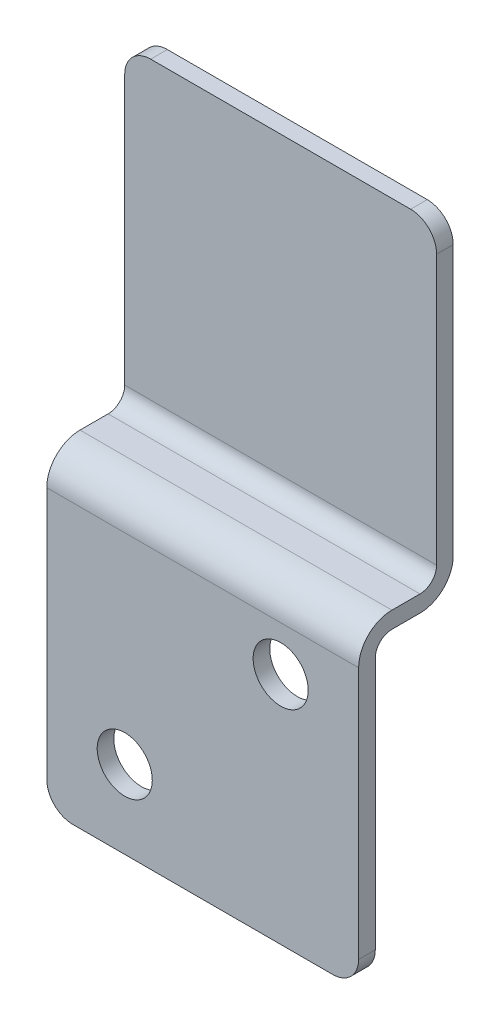
ISO-10303-21;
HEADER;
FILE_DESCRIPTION(('STEP AP214'),'2;1');
FILE_NAME('part.step','',(''),(''),'','','');
FILE_SCHEMA(('AUTOMOTIVE_DESIGN { 1 0 10303 214 1 1 1 1 }'));
ENDSEC;
DATA;
#1=APPLICATION_CONTEXT('core data for automotive mechanical design processes');
#2=APPLICATION_PROTOCOL_DEFINITION('international standard','automotive_design',2000,#1);
#3=PRODUCT_CONTEXT('',#1,'mechanical');
#4=PRODUCT('Part','Part','',(#3));
#5=PRODUCT_RELATED_PRODUCT_CATEGORY('part','',(#4));
#6=PRODUCT_DEFINITION_FORMATION('','',#4);
#7=PRODUCT_DEFINITION_CONTEXT('part definition',#1,'design');
#8=PRODUCT_DEFINITION('design','',#6,#7);
#9=PRODUCT_DEFINITION_SHAPE('','',#8);
#10=(LENGTH_UNIT() NAMED_UNIT(*) SI_UNIT(.MILLI.,.METRE.));
#11=(NAMED_UNIT(*) PLANE_ANGLE_UNIT() SI_UNIT($,.RADIAN.));
#12=(NAMED_UNIT(*) SI_UNIT($,.STERADIAN.) SOLID_ANGLE_UNIT());
#13=UNCERTAINTY_MEASURE_WITH_UNIT(LENGTH_MEASURE(1.E-05),#10,'distance_accuracy_value','');
#14=(GEOMETRIC_REPRESENTATION_CONTEXT(3) GLOBAL_UNCERTAINTY_ASSIGNED_CONTEXT((#13)) GLOBAL_UNIT_ASSIGNED_CONTEXT((#10,
#11,#12)) REPRESENTATION_CONTEXT('',''));
#15=CARTESIAN_POINT('',(0.,0.,0.));
#16=DIRECTION('',(0.,0.,1.));
#17=DIRECTION('',(1.,0.,0.));
#18=AXIS2_PLACEMENT_3D('',#15,#16,#17);
#19=CARTESIAN_POINT('',(38.1,0.,0.));
#20=DIRECTION('',(0.,-1.,0.));
#21=DIRECTION('',(0.,0.,-1.));
#22=AXIS2_PLACEMENT_3D('',#19,#20,#21);
#23=PLANE('',#22);
#24=DIRECTION('',(-1.,0.,0.));
#25=VECTOR('',#24,1.);
#26=CARTESIAN_POINT('',(38.1,0.,-2.032));
#27=LINE('',#26,#25);
#28=CARTESIAN_POINT('',(34.925,0.,-2.032));
#29=VERTEX_POINT('',#28);
#30=CARTESIAN_POINT('',(3.17500000000001,0.,-2.032));
#31=VERTEX_POINT('',#30);
#32=EDGE_CURVE('E187',#29,#31,#27,.T.);
#33=ORIENTED_EDGE('',*,*,#32,.T.);
#34=DIRECTION('',(0.,0.,1.));
#35=VECTOR('',#34,1.);
#36=CARTESIAN_POINT('',(3.175,0.,0.));
#37=LINE('',#36,#35);
#38=CARTESIAN_POINT('',(3.17500000000001,0.,0.));
#39=VERTEX_POINT('',#38);
#40=EDGE_CURVE('E247',#31,#39,#37,.T.);
#41=ORIENTED_EDGE('',*,*,#40,.T.);
#42=DIRECTION('',(-1.,0.,0.));
#43=VECTOR('',#42,1.);
#44=CARTESIAN_POINT('',(38.1,0.,0.));
#45=LINE('',#44,#43);
#46=CARTESIAN_POINT('',(34.925,0.,0.));
#47=VERTEX_POINT('',#46);
#48=EDGE_CURVE('E172',#47,#39,#45,.T.);
#49=ORIENTED_EDGE('',*,*,#48,.F.);
#50=DIRECTION('',(0.,0.,1.));
#51=VECTOR('',#50,1.);
#52=CARTESIAN_POINT('',(34.925,0.,0.));
#53=LINE('',#52,#51);
#54=EDGE_CURVE('E245',#47,#29,#53,.F.);
#55=ORIENTED_EDGE('',*,*,#54,.T.);
#56=EDGE_LOOP('',(#33,#41,#49,#55));
#57=FACE_BOUND('',#56,.T.);
#58=ADVANCED_FACE('F32',(#57),#23,.F.);
#59=CARTESIAN_POINT('',(38.1,0.,0.));
#60=DIRECTION('',(0.,0.,-1.));
#61=DIRECTION('',(0.,1.,0.));
#62=AXIS2_PLACEMENT_3D('',#59,#60,#61);
#63=PLANE('',#62);
#64=ORIENTED_EDGE('',*,*,#48,.T.);
#65=CARTESIAN_POINT('',(3.175,-3.175,0.));
#66=DIRECTION('',(0.,0.,-1.));
#67=DIRECTION('',(0.,1.,0.));
#68=AXIS2_PLACEMENT_3D('',#65,#66,#67);
#69=CIRCLE('',#68,3.175);
#70=CARTESIAN_POINT('',(0.,-3.175,0.));
#71=VERTEX_POINT('',#70);
#72=EDGE_CURVE('E251',#39,#71,#69,.F.);
#73=ORIENTED_EDGE('',*,*,#72,.T.);
#74=DIRECTION('',(0.,-1.,0.));
#75=VECTOR('',#74,1.);
#76=CARTESIAN_POINT('',(0.,0.,0.));
#77=LINE('',#76,#75);
#78=CARTESIAN_POINT('',(0.,-36.068,0.));
#79=VERTEX_POINT('',#78);
#80=EDGE_CURVE('E262',#71,#79,#77,.T.);
#81=ORIENTED_EDGE('',*,*,#80,.T.);
#82=DIRECTION('',(-1.,0.,0.));
#83=VECTOR('',#82,1.);
#84=CARTESIAN_POINT('',(38.1,-36.068,0.));
#85=LINE('',#84,#83);
#86=CARTESIAN_POINT('',(38.1,-36.068,0.));
#87=VERTEX_POINT('',#86);
#88=EDGE_CURVE('E162',#79,#87,#85,.F.);
#89=ORIENTED_EDGE('',*,*,#88,.T.);
#90=DIRECTION('',(0.,-1.,0.));
#91=VECTOR('',#90,1.);
#92=CARTESIAN_POINT('',(38.1,0.,0.));
#93=LINE('',#92,#91);
#94=CARTESIAN_POINT('',(38.1,-3.175,0.));
#95=VERTEX_POINT('',#94);
#96=EDGE_CURVE('E181',#95,#87,#93,.T.);
#97=ORIENTED_EDGE('',*,*,#96,.F.);
#98=CARTESIAN_POINT('',(34.925,-3.175,0.));
#99=DIRECTION('',(0.,0.,-1.));
#100=DIRECTION('',(0.,1.,0.));
#101=AXIS2_PLACEMENT_3D('',#98,#99,#100);
#102=CIRCLE('',#101,3.175);
#103=EDGE_CURVE('E57',#95,#47,#102,.F.);
#104=ORIENTED_EDGE('',*,*,#103,.T.);
#105=EDGE_LOOP('',(#64,#73,#81,#89,#97,#104));
#106=FACE_BOUND('',#105,.T.);
#107=ADVANCED_FACE('F334',(#106),#63,.F.);
#108=CARTESIAN_POINT('',(38.1,-38.1,0.));
#109=DIRECTION('',(0.,-1.,0.));
#110=DIRECTION('',(0.,0.,-1.));
#111=AXIS2_PLACEMENT_3D('',#108,#109,#110);
#112=PLANE('',#111);
#113=DIRECTION('',(0.,0.,1.));
#114=VECTOR('',#113,1.);
#115=CARTESIAN_POINT('',(0.,-38.1,0.));
#116=LINE('',#115,#114);
#117=CARTESIAN_POINT('',(0.,-38.1,2.032));
#118=VERTEX_POINT('',#117);
#119=CARTESIAN_POINT('',(0.,-38.1,5.461));
#120=VERTEX_POINT('',#119);
#121=EDGE_CURVE('E283',#118,#120,#116,.T.);
#122=ORIENTED_EDGE('',*,*,#121,.T.);
#123=DIRECTION('',(-1.,0.,0.));
#124=VECTOR('',#123,1.);
#125=CARTESIAN_POINT('',(38.1,-38.1,5.461));
#126=LINE('',#125,#124);
#127=CARTESIAN_POINT('',(38.1,-38.1,5.461));
#128=VERTEX_POINT('',#127);
#129=EDGE_CURVE('E217',#120,#128,#126,.F.);
#130=ORIENTED_EDGE('',*,*,#129,.T.);
#131=DIRECTION('',(0.,0.,1.));
#132=VECTOR('',#131,1.);
#133=CARTESIAN_POINT('',(38.1,-38.1,0.));
#134=LINE('',#133,#132);
#135=CARTESIAN_POINT('',(38.1,-38.1,2.032));
#136=VERTEX_POINT('',#135);
#137=EDGE_CURVE('E272',#136,#128,#134,.T.);
#138=ORIENTED_EDGE('',*,*,#137,.F.);
#139=DIRECTION('',(-1.,0.,0.));
#140=VECTOR('',#139,1.);
#141=CARTESIAN_POINT('',(0.,-38.1,2.032));
#142=LINE('',#141,#140);
#143=EDGE_CURVE('E200',#136,#118,#142,.T.);
#144=ORIENTED_EDGE('',*,*,#143,.T.);
#145=EDGE_LOOP('',(#122,#130,#138,#144));
#146=FACE_BOUND('',#145,.T.);
#147=ADVANCED_FACE('F316',(#146),#112,.F.);
#148=CARTESIAN_POINT('',(38.1,-38.1,9.525));
#149=DIRECTION('',(0.,0.,-1.));
#150=DIRECTION('',(0.,1.,0.));
#151=AXIS2_PLACEMENT_3D('',#148,#149,#150);
#152=PLANE('',#151);
#153=CARTESIAN_POINT('',(9.525,-66.675,9.52500000000001));
#154=DIRECTION('',(0.,0.,1.));
#155=DIRECTION('',(1.,0.,0.));
#156=AXIS2_PLACEMENT_3D('',#153,#154,#155);
#157=CIRCLE('',#156,3.3655);
#158=CARTESIAN_POINT('',(12.8905,-66.675,9.52500000000001));
#159=VERTEX_POINT('',#158);
#160=EDGE_CURVE('E258',#159,#159,#157,.T.);
#161=ORIENTED_EDGE('',*,*,#160,.F.);
#162=EDGE_LOOP('',(#161));
#163=FACE_BOUND('',#162,.T.);
#164=CARTESIAN_POINT('',(28.575,-47.625,9.52500000000001));
#165=DIRECTION('',(0.,0.,1.));
#166=DIRECTION('',(1.,0.,0.));
#167=AXIS2_PLACEMENT_3D('',#164,#165,#166);
#168=CIRCLE('',#167,3.36549999999999);
#169=CARTESIAN_POINT('',(31.9405,-47.625,9.52500000000001));
#170=VERTEX_POINT('',#169);
#171=EDGE_CURVE('E264',#170,#170,#168,.T.);
#172=ORIENTED_EDGE('',*,*,#171,.F.);
#173=EDGE_LOOP('',(#172));
#174=FACE_BOUND('',#173,.T.);
#175=DIRECTION('',(0.,-1.,0.));
#176=VECTOR('',#175,1.);
#177=CARTESIAN_POINT('',(0.,-38.1,9.525));
#178=LINE('',#177,#176);
#179=CARTESIAN_POINT('',(0.,-42.164,9.525));
#180=VERTEX_POINT('',#179);
#181=CARTESIAN_POINT('',(0.,-73.025,9.52499999999999));
#182=VERTEX_POINT('',#181);
#183=EDGE_CURVE('E183',#180,#182,#178,.T.);
#184=ORIENTED_EDGE('',*,*,#183,.T.);
#185=CARTESIAN_POINT('',(3.175,-73.025,9.52499999999999));
#186=DIRECTION('',(0.,0.,-1.));
#187=DIRECTION('',(0.,1.,0.));
#188=AXIS2_PLACEMENT_3D('',#185,#186,#187);
#189=CIRCLE('',#188,3.175);
#190=CARTESIAN_POINT('',(3.17500000000001,-76.2,9.52499999999999));
#191=VERTEX_POINT('',#190);
#192=EDGE_CURVE('E243',#182,#191,#189,.F.);
#193=ORIENTED_EDGE('',*,*,#192,.T.);
#194=DIRECTION('',(-1.,0.,0.));
#195=VECTOR('',#194,1.);
#196=CARTESIAN_POINT('',(38.1,-76.2,9.52499999999999));
#197=LINE('',#196,#195);
#198=CARTESIAN_POINT('',(34.925,-76.2,9.52499999999999));
#199=VERTEX_POINT('',#198);
#200=EDGE_CURVE('E194',#199,#191,#197,.T.);
#201=ORIENTED_EDGE('',*,*,#200,.F.);
#202=CARTESIAN_POINT('',(34.925,-73.025,9.52499999999999));
#203=DIRECTION('',(0.,0.,-1.));
#204=DIRECTION('',(0.,1.,0.));
#205=AXIS2_PLACEMENT_3D('',#202,#203,#204);
#206=CIRCLE('',#205,3.175);
#207=CARTESIAN_POINT('',(38.1,-73.025,9.52499999999999));
#208=VERTEX_POINT('',#207);
#209=EDGE_CURVE('E241',#199,#208,#206,.F.);
#210=ORIENTED_EDGE('',*,*,#209,.T.);
#211=DIRECTION('',(0.,-1.,0.));
#212=VECTOR('',#211,1.);
#213=CARTESIAN_POINT('',(38.1,-38.1,9.525));
#214=LINE('',#213,#212);
#215=CARTESIAN_POINT('',(38.1,-42.164,9.525));
#216=VERTEX_POINT('',#215);
#217=EDGE_CURVE('E275',#216,#208,#214,.T.);
#218=ORIENTED_EDGE('',*,*,#217,.F.);
#219=DIRECTION('',(-1.,0.,0.));
#220=VECTOR('',#219,1.);
#221=CARTESIAN_POINT('',(38.1,-42.164,9.525));
#222=LINE('',#221,#220);
#223=EDGE_CURVE('E211',#216,#180,#222,.T.);
#224=ORIENTED_EDGE('',*,*,#223,.T.);
#225=EDGE_LOOP('',(#184,#193,#201,#210,#218,#224));
#226=FACE_BOUND('',#225,.T.);
#227=ADVANCED_FACE('F289',(#163,#174,#226),#152,.F.);
#228=CARTESIAN_POINT('',(38.1,-76.2,9.52499999999999));
#229=DIRECTION('',(0.,1.,0.));
#230=DIRECTION('',(0.,0.,1.));
#231=AXIS2_PLACEMENT_3D('',#228,#229,#230);
#232=PLANE('',#231);
#233=ORIENTED_EDGE('',*,*,#200,.T.);
#234=DIRECTION('',(0.,0.,-1.));
#235=VECTOR('',#234,1.);
#236=CARTESIAN_POINT('',(3.175,-76.2,7.49299999999999));
#237=LINE('',#236,#235);
#238=CARTESIAN_POINT('',(3.17500000000001,-76.2,7.49299999999999));
#239=VERTEX_POINT('',#238);
#240=EDGE_CURVE('E230',#191,#239,#237,.T.);
#241=ORIENTED_EDGE('',*,*,#240,.T.);
#242=DIRECTION('',(-1.,0.,0.));
#243=VECTOR('',#242,1.);
#244=CARTESIAN_POINT('',(38.1,-76.2,7.49299999999999));
#245=LINE('',#244,#243);
#246=CARTESIAN_POINT('',(34.925,-76.2,7.49299999999999));
#247=VERTEX_POINT('',#246);
#248=EDGE_CURVE('E190',#247,#239,#245,.T.);
#249=ORIENTED_EDGE('',*,*,#248,.F.);
#250=DIRECTION('',(0.,0.,-1.));
#251=VECTOR('',#250,1.);
#252=CARTESIAN_POINT('',(34.925,-76.2,9.52499999999999));
#253=LINE('',#252,#251);
#254=EDGE_CURVE('E228',#247,#199,#253,.F.);
#255=ORIENTED_EDGE('',*,*,#254,.T.);
#256=EDGE_LOOP('',(#233,#241,#249,#255));
#257=FACE_BOUND('',#256,.T.);
#258=ADVANCED_FACE('F299',(#257),#232,.F.);
#259=CARTESIAN_POINT('',(38.1,-40.132,7.493));
#260=DIRECTION('',(0.,0.,1.));
#261=DIRECTION('',(0.,-1.,0.));
#262=AXIS2_PLACEMENT_3D('',#259,#260,#261);
#263=PLANE('',#262);
#264=CARTESIAN_POINT('',(9.525,-66.675,7.49299999999999));
#265=DIRECTION('',(0.,0.,1.));
#266=DIRECTION('',(0.,-1.,0.));
#267=AXIS2_PLACEMENT_3D('',#264,#265,#266);
#268=CIRCLE('',#267,3.3655);
#269=CARTESIAN_POINT('',(9.525,-70.0405,7.49299999999999));
#270=VERTEX_POINT('',#269);
#271=EDGE_CURVE('E36',#270,#270,#268,.T.);
#272=ORIENTED_EDGE('',*,*,#271,.T.);
#273=EDGE_LOOP('',(#272));
#274=FACE_BOUND('',#273,.T.);
#275=CARTESIAN_POINT('',(28.575,-47.625,7.493));
#276=DIRECTION('',(0.,0.,1.));
#277=DIRECTION('',(0.,-1.,0.));
#278=AXIS2_PLACEMENT_3D('',#275,#276,#277);
#279=CIRCLE('',#278,3.36549999999999);
#280=CARTESIAN_POINT('',(28.575,-50.9905,7.493));
#281=VERTEX_POINT('',#280);
#282=EDGE_CURVE('E256',#281,#281,#279,.T.);
#283=ORIENTED_EDGE('',*,*,#282,.T.);
#284=EDGE_LOOP('',(#283));
#285=FACE_BOUND('',#284,.T.);
#286=ORIENTED_EDGE('',*,*,#248,.T.);
#287=CARTESIAN_POINT('',(3.175,-73.025,7.49299999999999));
#288=DIRECTION('',(0.,0.,1.));
#289=DIRECTION('',(0.,-1.,0.));
#290=AXIS2_PLACEMENT_3D('',#287,#288,#289);
#291=CIRCLE('',#290,3.175);
#292=CARTESIAN_POINT('',(0.,-73.025,7.49299999999999));
#293=VERTEX_POINT('',#292);
#294=EDGE_CURVE('E235',#239,#293,#291,.F.);
#295=ORIENTED_EDGE('',*,*,#294,.T.);
#296=DIRECTION('',(0.,1.,0.));
#297=VECTOR('',#296,1.);
#298=CARTESIAN_POINT('',(0.,-40.132,7.493));
#299=LINE('',#298,#297);
#300=CARTESIAN_POINT('',(0.,-42.164,7.493));
#301=VERTEX_POINT('',#300);
#302=EDGE_CURVE('E178',#293,#301,#299,.T.);
#303=ORIENTED_EDGE('',*,*,#302,.T.);
#304=DIRECTION('',(-1.,0.,0.));
#305=VECTOR('',#304,1.);
#306=CARTESIAN_POINT('',(38.1,-42.164,7.493));
#307=LINE('',#306,#305);
#308=CARTESIAN_POINT('',(38.1,-42.164,7.493));
#309=VERTEX_POINT('',#308);
#310=EDGE_CURVE('E157',#301,#309,#307,.F.);
#311=ORIENTED_EDGE('',*,*,#310,.T.);
#312=DIRECTION('',(0.,1.,0.));
#313=VECTOR('',#312,1.);
#314=CARTESIAN_POINT('',(38.1,-40.132,7.493));
#315=LINE('',#314,#313);
#316=CARTESIAN_POINT('',(38.1,-73.025,7.49299999999999));
#317=VERTEX_POINT('',#316);
#318=EDGE_CURVE('E278',#317,#309,#315,.T.);
#319=ORIENTED_EDGE('',*,*,#318,.F.);
#320=CARTESIAN_POINT('',(34.925,-73.025,7.49299999999999));
#321=DIRECTION('',(0.,0.,1.));
#322=DIRECTION('',(0.,-1.,0.));
#323=AXIS2_PLACEMENT_3D('',#320,#321,#322);
#324=CIRCLE('',#323,3.175);
#325=EDGE_CURVE('E233',#317,#247,#324,.F.);
#326=ORIENTED_EDGE('',*,*,#325,.T.);
#327=EDGE_LOOP('',(#286,#295,#303,#311,#319,#326));
#328=FACE_BOUND('',#327,.T.);
#329=ADVANCED_FACE('F302',(#274,#285,#328),#263,.F.);
#330=CARTESIAN_POINT('',(38.1,-40.132,-2.032));
#331=DIRECTION('',(0.,1.,0.));
#332=DIRECTION('',(0.,0.,1.));
#333=AXIS2_PLACEMENT_3D('',#330,#331,#332);
#334=PLANE('',#333);
#335=DIRECTION('',(0.,0.,-1.));
#336=VECTOR('',#335,1.);
#337=CARTESIAN_POINT('',(0.,-40.132,-2.032));
#338=LINE('',#337,#336);
#339=CARTESIAN_POINT('',(0.,-40.132,5.461));
#340=VERTEX_POINT('',#339);
#341=CARTESIAN_POINT('',(0.,-40.132,2.032));
#342=VERTEX_POINT('',#341);
#343=EDGE_CURVE('E168',#340,#342,#338,.T.);
#344=ORIENTED_EDGE('',*,*,#343,.T.);
#345=DIRECTION('',(-1.,0.,0.));
#346=VECTOR('',#345,1.);
#347=CARTESIAN_POINT('',(38.1,-40.132,2.032));
#348=LINE('',#347,#346);
#349=CARTESIAN_POINT('',(38.1,-40.132,2.032));
#350=VERTEX_POINT('',#349);
#351=EDGE_CURVE('E226',#342,#350,#348,.F.);
#352=ORIENTED_EDGE('',*,*,#351,.T.);
#353=DIRECTION('',(0.,0.,-1.));
#354=VECTOR('',#353,1.);
#355=CARTESIAN_POINT('',(38.1,-40.132,-2.032));
#356=LINE('',#355,#354);
#357=CARTESIAN_POINT('',(38.1,-40.132,5.461));
#358=VERTEX_POINT('',#357);
#359=EDGE_CURVE('E171',#358,#350,#356,.T.);
#360=ORIENTED_EDGE('',*,*,#359,.F.);
#361=DIRECTION('',(-1.,0.,0.));
#362=VECTOR('',#361,1.);
#363=CARTESIAN_POINT('',(0.,-40.132,5.461));
#364=LINE('',#363,#362);
#365=EDGE_CURVE('E155',#358,#340,#364,.T.);
#366=ORIENTED_EDGE('',*,*,#365,.T.);
#367=EDGE_LOOP('',(#344,#352,#360,#366));
#368=FACE_BOUND('',#367,.T.);
#369=ADVANCED_FACE('F167',(#368),#334,.F.);
#370=CARTESIAN_POINT('',(38.1,0.,-2.032));
#371=DIRECTION('',(0.,0.,1.));
#372=DIRECTION('',(0.,-1.,0.));
#373=AXIS2_PLACEMENT_3D('',#370,#371,#372);
#374=PLANE('',#373);
#375=DIRECTION('',(0.,1.,0.));
#376=VECTOR('',#375,1.);
#377=CARTESIAN_POINT('',(0.,0.,-2.032));
#378=LINE('',#377,#376);
#379=CARTESIAN_POINT('',(0.,-36.068,-2.032));
#380=VERTEX_POINT('',#379);
#381=CARTESIAN_POINT('',(0.,-3.175,-2.032));
#382=VERTEX_POINT('',#381);
#383=EDGE_CURVE('E177',#380,#382,#378,.T.);
#384=ORIENTED_EDGE('',*,*,#383,.T.);
#385=CARTESIAN_POINT('',(3.175,-3.175,-2.032));
#386=DIRECTION('',(0.,0.,1.));
#387=DIRECTION('',(0.,-1.,0.));
#388=AXIS2_PLACEMENT_3D('',#385,#386,#387);
#389=CIRCLE('',#388,3.175);
#390=EDGE_CURVE('E254',#382,#31,#389,.F.);
#391=ORIENTED_EDGE('',*,*,#390,.T.);
#392=ORIENTED_EDGE('',*,*,#32,.F.);
#393=CARTESIAN_POINT('',(34.925,-3.175,-2.032));
#394=DIRECTION('',(0.,0.,1.));
#395=DIRECTION('',(0.,-1.,0.));
#396=AXIS2_PLACEMENT_3D('',#393,#394,#395);
#397=CIRCLE('',#396,3.175);
#398=CARTESIAN_POINT('',(38.1,-3.175,-2.032));
#399=VERTEX_POINT('',#398);
#400=EDGE_CURVE('E49',#29,#399,#397,.F.);
#401=ORIENTED_EDGE('',*,*,#400,.T.);
#402=DIRECTION('',(0.,1.,0.));
#403=VECTOR('',#402,1.);
#404=CARTESIAN_POINT('',(38.1,0.,-2.032));
#405=LINE('',#404,#403);
#406=CARTESIAN_POINT('',(38.1,-36.068,-2.032));
#407=VERTEX_POINT('',#406);
#408=EDGE_CURVE('E191',#407,#399,#405,.T.);
#409=ORIENTED_EDGE('',*,*,#408,.F.);
#410=DIRECTION('',(-1.,0.,0.));
#411=VECTOR('',#410,1.);
#412=CARTESIAN_POINT('',(38.1,-36.068,-2.032));
#413=LINE('',#412,#411);
#414=EDGE_CURVE('E223',#407,#380,#413,.T.);
#415=ORIENTED_EDGE('',*,*,#414,.T.);
#416=EDGE_LOOP('',(#384,#391,#392,#401,#409,#415));
#417=FACE_BOUND('',#416,.T.);
#418=ADVANCED_FACE('F330',(#417),#374,.F.);
#419=CARTESIAN_POINT('',(38.1,0.,0.));
#420=DIRECTION('',(-1.,0.,0.));
#421=DIRECTION('',(0.,0.,1.));
#422=AXIS2_PLACEMENT_3D('',#419,#420,#421);
#423=PLANE('',#422);
#424=ORIENTED_EDGE('',*,*,#217,.T.);
#425=DIRECTION('',(0.,0.,-1.));
#426=VECTOR('',#425,1.);
#427=CARTESIAN_POINT('',(38.1,-73.025,0.));
#428=LINE('',#427,#426);
#429=EDGE_CURVE('E11',#208,#317,#428,.T.);
#430=ORIENTED_EDGE('',*,*,#429,.T.);
#431=ORIENTED_EDGE('',*,*,#318,.T.);
#432=CARTESIAN_POINT('',(38.1,-42.164,5.461));
#433=DIRECTION('',(-1.,0.,0.));
#434=DIRECTION('',(0.,0.,1.));
#435=AXIS2_PLACEMENT_3D('',#432,#433,#434);
#436=CIRCLE('',#435,2.032);
#437=EDGE_CURVE('E161',#309,#358,#436,.T.);
#438=ORIENTED_EDGE('',*,*,#437,.T.);
#439=ORIENTED_EDGE('',*,*,#359,.T.);
#440=CARTESIAN_POINT('',(38.1,-36.068,2.03199999999999));
#441=DIRECTION('',(-1.,0.,0.));
#442=DIRECTION('',(0.,0.,1.));
#443=AXIS2_PLACEMENT_3D('',#440,#441,#442);
#444=CIRCLE('',#443,4.064);
#445=EDGE_CURVE('E219',#350,#407,#444,.F.);
#446=ORIENTED_EDGE('',*,*,#445,.T.);
#447=ORIENTED_EDGE('',*,*,#408,.T.);
#448=DIRECTION('',(0.,0.,1.));
#449=VECTOR('',#448,1.);
#450=CARTESIAN_POINT('',(38.1,-3.175,0.));
#451=LINE('',#450,#449);
#452=EDGE_CURVE('E41',#399,#95,#451,.T.);
#453=ORIENTED_EDGE('',*,*,#452,.T.);
#454=ORIENTED_EDGE('',*,*,#96,.T.);
#455=CARTESIAN_POINT('',(38.1,-36.068,2.032));
#456=DIRECTION('',(-1.,0.,0.));
#457=DIRECTION('',(0.,0.,1.));
#458=AXIS2_PLACEMENT_3D('',#455,#456,#457);
#459=CIRCLE('',#458,2.032);
#460=EDGE_CURVE('E209',#87,#136,#459,.T.);
#461=ORIENTED_EDGE('',*,*,#460,.T.);
#462=ORIENTED_EDGE('',*,*,#137,.T.);
#463=CARTESIAN_POINT('',(38.1,-42.164,5.461));
#464=DIRECTION('',(-1.,0.,0.));
#465=DIRECTION('',(0.,0.,1.));
#466=AXIS2_PLACEMENT_3D('',#463,#464,#465);
#467=CIRCLE('',#466,4.064);
#468=EDGE_CURVE('E221',#128,#216,#467,.F.);
#469=ORIENTED_EDGE('',*,*,#468,.T.);
#470=EDGE_LOOP('',(#424,#430,#431,#438,#439,#446,#447,#453,#454,#461,#462,#469));
#471=FACE_BOUND('',#470,.T.);
#472=ADVANCED_FACE('F309',(#471),#423,.F.);
#473=CARTESIAN_POINT('',(0.,0.,0.));
#474=DIRECTION('',(-1.,0.,0.));
#475=DIRECTION('',(0.,0.,1.));
#476=AXIS2_PLACEMENT_3D('',#473,#474,#475);
#477=PLANE('',#476);
#478=ORIENTED_EDGE('',*,*,#302,.F.);
#479=DIRECTION('',(0.,0.,-1.));
#480=VECTOR('',#479,1.);
#481=CARTESIAN_POINT('',(0.,-73.025,9.52499999999999));
#482=LINE('',#481,#480);
#483=EDGE_CURVE('E239',#293,#182,#482,.F.);
#484=ORIENTED_EDGE('',*,*,#483,.T.);
#485=ORIENTED_EDGE('',*,*,#183,.F.);
#486=CARTESIAN_POINT('',(0.,-42.164,5.461));
#487=DIRECTION('',(-1.,0.,0.));
#488=DIRECTION('',(0.,0.,1.));
#489=AXIS2_PLACEMENT_3D('',#486,#487,#488);
#490=CIRCLE('',#489,4.064);
#491=EDGE_CURVE('E215',#180,#120,#490,.T.);
#492=ORIENTED_EDGE('',*,*,#491,.T.);
#493=ORIENTED_EDGE('',*,*,#121,.F.);
#494=CARTESIAN_POINT('',(0.,-36.068,2.032));
#495=DIRECTION('',(-1.,0.,0.));
#496=DIRECTION('',(0.,0.,1.));
#497=AXIS2_PLACEMENT_3D('',#494,#495,#496);
#498=CIRCLE('',#497,2.032);
#499=EDGE_CURVE('E206',#118,#79,#498,.F.);
#500=ORIENTED_EDGE('',*,*,#499,.T.);
#501=ORIENTED_EDGE('',*,*,#80,.F.);
#502=DIRECTION('',(0.,0.,1.));
#503=VECTOR('',#502,1.);
#504=CARTESIAN_POINT('',(0.,-3.175,-2.032));
#505=LINE('',#504,#503);
#506=EDGE_CURVE('E237',#71,#382,#505,.F.);
#507=ORIENTED_EDGE('',*,*,#506,.T.);
#508=ORIENTED_EDGE('',*,*,#383,.F.);
#509=CARTESIAN_POINT('',(0.,-36.068,2.03199999999999));
#510=DIRECTION('',(-1.,0.,0.));
#511=DIRECTION('',(0.,0.,1.));
#512=AXIS2_PLACEMENT_3D('',#509,#510,#511);
#513=CIRCLE('',#512,4.064);
#514=EDGE_CURVE('E176',#380,#342,#513,.T.);
#515=ORIENTED_EDGE('',*,*,#514,.T.);
#516=ORIENTED_EDGE('',*,*,#343,.F.);
#517=CARTESIAN_POINT('',(0.,-42.164,5.461));
#518=DIRECTION('',(-1.,0.,0.));
#519=DIRECTION('',(0.,0.,1.));
#520=AXIS2_PLACEMENT_3D('',#517,#518,#519);
#521=CIRCLE('',#520,2.032);
#522=EDGE_CURVE('E151',#340,#301,#521,.F.);
#523=ORIENTED_EDGE('',*,*,#522,.T.);
#524=EDGE_LOOP('',(#478,#484,#485,#492,#493,#500,#501,#507,#508,#515,#516,#523));
#525=FACE_BOUND('',#524,.T.);
#526=ADVANCED_FACE('F174',(#525),#477,.T.);
#527=CARTESIAN_POINT('',(38.1,-42.164,5.461));
#528=DIRECTION('',(1.,0.,0.));
#529=DIRECTION('',(0.,0.,-1.));
#530=AXIS2_PLACEMENT_3D('',#527,#528,#529);
#531=CYLINDRICAL_SURFACE('',#530,2.032);
#532=ORIENTED_EDGE('',*,*,#437,.F.);
#533=ORIENTED_EDGE('',*,*,#310,.F.);
#534=ORIENTED_EDGE('',*,*,#522,.F.);
#535=ORIENTED_EDGE('',*,*,#365,.F.);
#536=EDGE_LOOP('',(#532,#533,#534,#535));
#537=FACE_BOUND('',#536,.T.);
#538=ADVANCED_FACE('F154',(#537),#531,.F.);
#539=CARTESIAN_POINT('',(38.1,-36.068,2.032));
#540=DIRECTION('',(1.,0.,0.));
#541=DIRECTION('',(0.,0.,-1.));
#542=AXIS2_PLACEMENT_3D('',#539,#540,#541);
#543=CYLINDRICAL_SURFACE('',#542,2.032);
#544=ORIENTED_EDGE('',*,*,#460,.F.);
#545=ORIENTED_EDGE('',*,*,#88,.F.);
#546=ORIENTED_EDGE('',*,*,#499,.F.);
#547=ORIENTED_EDGE('',*,*,#143,.F.);
#548=EDGE_LOOP('',(#544,#545,#546,#547));
#549=FACE_BOUND('',#548,.T.);
#550=ADVANCED_FACE('F321',(#549),#543,.F.);
#551=CARTESIAN_POINT('',(38.1,-42.164,5.461));
#552=DIRECTION('',(-1.,0.,0.));
#553=DIRECTION('',(0.,0.,1.));
#554=AXIS2_PLACEMENT_3D('',#551,#552,#553);
#555=CYLINDRICAL_SURFACE('',#554,4.064);
#556=ORIENTED_EDGE('',*,*,#468,.F.);
#557=ORIENTED_EDGE('',*,*,#129,.F.);
#558=ORIENTED_EDGE('',*,*,#491,.F.);
#559=ORIENTED_EDGE('',*,*,#223,.F.);
#560=EDGE_LOOP('',(#556,#557,#558,#559));
#561=FACE_BOUND('',#560,.T.);
#562=ADVANCED_FACE('F312',(#561),#555,.T.);
#563=CARTESIAN_POINT('',(38.1,-36.068,2.03199999999999));
#564=DIRECTION('',(-1.,0.,0.));
#565=DIRECTION('',(0.,0.,1.));
#566=AXIS2_PLACEMENT_3D('',#563,#564,#565);
#567=CYLINDRICAL_SURFACE('',#566,4.064);
#568=ORIENTED_EDGE('',*,*,#445,.F.);
#569=ORIENTED_EDGE('',*,*,#351,.F.);
#570=ORIENTED_EDGE('',*,*,#514,.F.);
#571=ORIENTED_EDGE('',*,*,#414,.F.);
#572=EDGE_LOOP('',(#568,#569,#570,#571));
#573=FACE_BOUND('',#572,.T.);
#574=ADVANCED_FACE('F351',(#573),#567,.T.);
#575=CARTESIAN_POINT('',(3.175,-73.025,9.52499999999999));
#576=DIRECTION('',(0.,0.,1.));
#577=DIRECTION('',(1.,0.,0.));
#578=AXIS2_PLACEMENT_3D('',#575,#576,#577);
#579=CYLINDRICAL_SURFACE('',#578,3.175);
#580=ORIENTED_EDGE('',*,*,#192,.F.);
#581=ORIENTED_EDGE('',*,*,#483,.F.);
#582=ORIENTED_EDGE('',*,*,#294,.F.);
#583=ORIENTED_EDGE('',*,*,#240,.F.);
#584=EDGE_LOOP('',(#580,#581,#582,#583));
#585=FACE_BOUND('',#584,.T.);
#586=ADVANCED_FACE('F296',(#585),#579,.T.);
#587=CARTESIAN_POINT('',(3.175,-3.175,0.));
#588=DIRECTION('',(0.,0.,-1.));
#589=DIRECTION('',(-1.,0.,0.));
#590=AXIS2_PLACEMENT_3D('',#587,#588,#589);
#591=CYLINDRICAL_SURFACE('',#590,3.175);
#592=ORIENTED_EDGE('',*,*,#390,.F.);
#593=ORIENTED_EDGE('',*,*,#506,.F.);
#594=ORIENTED_EDGE('',*,*,#72,.F.);
#595=ORIENTED_EDGE('',*,*,#40,.F.);
#596=EDGE_LOOP('',(#592,#593,#594,#595));
#597=FACE_BOUND('',#596,.T.);
#598=ADVANCED_FACE('F328',(#597),#591,.T.);
#599=CARTESIAN_POINT('',(34.925,-73.025,0.));
#600=DIRECTION('',(0.,0.,-1.));
#601=DIRECTION('',(-1.,0.,0.));
#602=AXIS2_PLACEMENT_3D('',#599,#600,#601);
#603=CYLINDRICAL_SURFACE('',#602,3.175);
#604=ORIENTED_EDGE('',*,*,#209,.F.);
#605=ORIENTED_EDGE('',*,*,#254,.F.);
#606=ORIENTED_EDGE('',*,*,#325,.F.);
#607=ORIENTED_EDGE('',*,*,#429,.F.);
#608=EDGE_LOOP('',(#604,#605,#606,#607));
#609=FACE_BOUND('',#608,.T.);
#610=ADVANCED_FACE('F307',(#609),#603,.T.);
#611=CARTESIAN_POINT('',(34.925,-3.175,0.));
#612=DIRECTION('',(0.,0.,1.));
#613=DIRECTION('',(1.,0.,0.));
#614=AXIS2_PLACEMENT_3D('',#611,#612,#613);
#615=CYLINDRICAL_SURFACE('',#614,3.175);
#616=ORIENTED_EDGE('',*,*,#400,.F.);
#617=ORIENTED_EDGE('',*,*,#54,.F.);
#618=ORIENTED_EDGE('',*,*,#103,.F.);
#619=ORIENTED_EDGE('',*,*,#452,.F.);
#620=EDGE_LOOP('',(#616,#617,#618,#619));
#621=FACE_BOUND('',#620,.T.);
#622=ADVANCED_FACE('F34',(#621),#615,.T.);
#623=CARTESIAN_POINT('',(28.575,-47.625,-2.03200000000001));
#624=DIRECTION('',(0.,0.,1.));
#625=DIRECTION('',(1.,0.,0.));
#626=AXIS2_PLACEMENT_3D('',#623,#624,#625);
#627=CYLINDRICAL_SURFACE('',#626,3.36549999999999);
#628=ORIENTED_EDGE('',*,*,#171,.T.);
#629=EDGE_LOOP('',(#628));
#630=FACE_BOUND('',#629,.T.);
#631=ORIENTED_EDGE('',*,*,#282,.F.);
#632=EDGE_LOOP('',(#631));
#633=FACE_BOUND('',#632,.T.);
#634=ADVANCED_FACE('F362',(#630,#633),#627,.F.);
#635=CARTESIAN_POINT('',(9.525,-66.675,-2.03200000000001));
#636=DIRECTION('',(0.,0.,1.));
#637=DIRECTION('',(1.,0.,0.));
#638=AXIS2_PLACEMENT_3D('',#635,#636,#637);
#639=CYLINDRICAL_SURFACE('',#638,3.3655);
#640=ORIENTED_EDGE('',*,*,#160,.T.);
#641=EDGE_LOOP('',(#640));
#642=FACE_BOUND('',#641,.T.);
#643=ORIENTED_EDGE('',*,*,#271,.F.);
#644=EDGE_LOOP('',(#643));
#645=FACE_BOUND('',#644,.T.);
#646=ADVANCED_FACE('F366',(#642,#645),#639,.F.);
#647=CLOSED_SHELL('',(#58,#107,#147,#227,#258,#329,#369,#418,#472,#526,#538,#550,#562,#574,#586,
#598,#610,#622,#634,#646));
#648=MANIFOLD_SOLID_BREP('B2',#647);
#649=ADVANCED_BREP_SHAPE_REPRESENTATION('',(#18,#648),#14);
#650=SHAPE_DEFINITION_REPRESENTATION(#9,#649);
ENDSEC;
END-ISO-10303-21;
